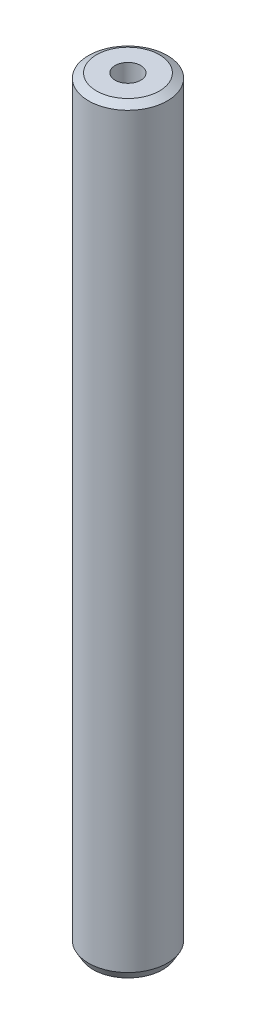
ISO-10303-21;
HEADER;
FILE_DESCRIPTION(('STEP AP214'),'2;1');
FILE_NAME('part.step','',(''),(''),'','','');
FILE_SCHEMA(('AUTOMOTIVE_DESIGN { 1 0 10303 214 1 1 1 1 }'));
ENDSEC;
DATA;
#1=APPLICATION_CONTEXT('core data for automotive mechanical design processes');
#2=APPLICATION_PROTOCOL_DEFINITION('international standard','automotive_design',2000,#1);
#3=PRODUCT_CONTEXT('',#1,'mechanical');
#4=PRODUCT('Part','Part','',(#3));
#5=PRODUCT_RELATED_PRODUCT_CATEGORY('part','',(#4));
#6=PRODUCT_DEFINITION_FORMATION('','',#4);
#7=PRODUCT_DEFINITION_CONTEXT('part definition',#1,'design');
#8=PRODUCT_DEFINITION('design','',#6,#7);
#9=PRODUCT_DEFINITION_SHAPE('','',#8);
#10=(LENGTH_UNIT() NAMED_UNIT(*) SI_UNIT(.MILLI.,.METRE.));
#11=(NAMED_UNIT(*) PLANE_ANGLE_UNIT() SI_UNIT($,.RADIAN.));
#12=(NAMED_UNIT(*) SI_UNIT($,.STERADIAN.) SOLID_ANGLE_UNIT());
#13=UNCERTAINTY_MEASURE_WITH_UNIT(LENGTH_MEASURE(1.E-05),#10,'distance_accuracy_value','');
#14=(GEOMETRIC_REPRESENTATION_CONTEXT(3) GLOBAL_UNCERTAINTY_ASSIGNED_CONTEXT((#13)) GLOBAL_UNIT_ASSIGNED_CONTEXT((#10,
#11,#12)) REPRESENTATION_CONTEXT('',''));
#15=CARTESIAN_POINT('',(0.,0.,0.));
#16=DIRECTION('',(0.,0.,1.));
#17=DIRECTION('',(1.,0.,0.));
#18=AXIS2_PLACEMENT_3D('',#15,#16,#17);
#19=CARTESIAN_POINT('',(0.,192.751851064715,0.));
#20=DIRECTION('',(0.,-1.,0.));
#21=DIRECTION('',(0.,0.,-1.));
#22=AXIS2_PLACEMENT_3D('',#19,#20,#21);
#23=CYLINDRICAL_SURFACE('',#22,10.);
#24=CARTESIAN_POINT('',(0.,191.585423618501,0.));
#25=DIRECTION('',(0.,1.,0.));
#26=DIRECTION('',(0.,0.,1.));
#27=AXIS2_PLACEMENT_3D('',#24,#25,#26);
#28=CIRCLE('',#27,10.);
#29=CARTESIAN_POINT('',(0.,191.585423618501,10.));
#30=VERTEX_POINT('',#29);
#31=EDGE_CURVE('E50',#30,#30,#28,.F.);
#32=ORIENTED_EDGE('',*,*,#31,.T.);
#33=EDGE_LOOP('',(#32));
#34=FACE_BOUND('',#33,.T.);
#35=CARTESIAN_POINT('',(0.,2.02031160018543,0.));
#36=DIRECTION('',(0.,1.,0.));
#37=DIRECTION('',(0.,0.,1.));
#38=AXIS2_PLACEMENT_3D('',#35,#36,#37);
#39=CIRCLE('',#38,10.);
#40=CARTESIAN_POINT('',(0.,2.02031160018543,10.));
#41=VERTEX_POINT('',#40);
#42=EDGE_CURVE('E51',#41,#41,#39,.T.);
#43=ORIENTED_EDGE('',*,*,#42,.T.);
#44=EDGE_LOOP('',(#43));
#45=FACE_BOUND('',#44,.T.);
#46=ADVANCED_FACE('F39',(#34,#45),#23,.T.);
#47=CARTESIAN_POINT('',(0.,192.751851064715,0.));
#48=DIRECTION('',(0.,1.,0.));
#49=DIRECTION('',(0.,0.,1.));
#50=AXIS2_PLACEMENT_3D('',#47,#48,#49);
#51=PLANE('',#50);
#52=CARTESIAN_POINT('',(0.,192.751851064715,0.));
#53=DIRECTION('',(0.,1.,0.));
#54=DIRECTION('',(0.,0.,1.));
#55=AXIS2_PLACEMENT_3D('',#52,#53,#54);
#56=CIRCLE('',#55,7.97968839981461);
#57=CARTESIAN_POINT('',(0.,192.751851064715,7.97968839981461));
#58=VERTEX_POINT('',#57);
#59=EDGE_CURVE('E54',#58,#58,#56,.T.);
#60=ORIENTED_EDGE('',*,*,#59,.T.);
#61=EDGE_LOOP('',(#60));
#62=FACE_BOUND('',#61,.T.);
#63=CARTESIAN_POINT('',(0.,192.751851064715,0.));
#64=DIRECTION('',(0.,1.,0.));
#65=DIRECTION('',(0.,0.,1.));
#66=AXIS2_PLACEMENT_3D('',#63,#64,#65);
#67=CIRCLE('',#66,3.24997536875379);
#68=CARTESIAN_POINT('',(0.,192.751851064715,3.24997536875379));
#69=VERTEX_POINT('',#68);
#70=EDGE_CURVE('E58',#69,#69,#67,.T.);
#71=ORIENTED_EDGE('',*,*,#70,.F.);
#72=EDGE_LOOP('',(#71));
#73=FACE_BOUND('',#72,.T.);
#74=ADVANCED_FACE('F69',(#62,#73),#51,.T.);
#75=CARTESIAN_POINT('',(0.,0.,0.));
#76=DIRECTION('',(0.,1.,0.));
#77=DIRECTION('',(0.,0.,1.));
#78=AXIS2_PLACEMENT_3D('',#75,#76,#77);
#79=PLANE('',#78);
#80=CARTESIAN_POINT('',(0.,0.,0.));
#81=DIRECTION('',(0.,1.,0.));
#82=DIRECTION('',(0.,0.,1.));
#83=AXIS2_PLACEMENT_3D('',#80,#81,#82);
#84=CIRCLE('',#83,8.833572553786);
#85=CARTESIAN_POINT('',(0.,0.,8.833572553786));
#86=VERTEX_POINT('',#85);
#87=EDGE_CURVE('E10',#86,#86,#84,.F.);
#88=ORIENTED_EDGE('',*,*,#87,.T.);
#89=EDGE_LOOP('',(#88));
#90=FACE_BOUND('',#89,.T.);
#91=CARTESIAN_POINT('',(0.,0.,0.));
#92=DIRECTION('',(0.,1.,0.));
#93=DIRECTION('',(0.,0.,1.));
#94=AXIS2_PLACEMENT_3D('',#91,#92,#93);
#95=CIRCLE('',#94,3.24997536875379);
#96=CARTESIAN_POINT('',(0.,0.,3.24997536875379));
#97=VERTEX_POINT('',#96);
#98=EDGE_CURVE('E63',#97,#97,#95,.T.);
#99=ORIENTED_EDGE('',*,*,#98,.T.);
#100=EDGE_LOOP('',(#99));
#101=FACE_BOUND('',#100,.T.);
#102=ADVANCED_FACE('F75',(#90,#101),#79,.F.);
#103=CARTESIAN_POINT('',(0.,192.751851064715,0.));
#104=DIRECTION('',(0.,-1.,0.));
#105=DIRECTION('',(0.,0.,-1.));
#106=AXIS2_PLACEMENT_3D('',#103,#104,#105);
#107=CYLINDRICAL_SURFACE('',#106,3.24997536875379);
#108=ORIENTED_EDGE('',*,*,#70,.T.);
#109=EDGE_LOOP('',(#108));
#110=FACE_BOUND('',#109,.T.);
#111=ORIENTED_EDGE('',*,*,#98,.F.);
#112=EDGE_LOOP('',(#111));
#113=FACE_BOUND('',#112,.T.);
#114=ADVANCED_FACE('F70',(#110,#113),#107,.F.);
#115=CARTESIAN_POINT('',(0.,192.751851064715,0.));
#116=DIRECTION('',(0.,-1.,0.));
#117=DIRECTION('',(0.,0.,-1.));
#118=AXIS2_PLACEMENT_3D('',#115,#116,#117);
#119=CONICAL_SURFACE('',#118,7.97968839981461,1.04719755119659);
#120=ORIENTED_EDGE('',*,*,#31,.F.);
#121=EDGE_LOOP('',(#120));
#122=FACE_BOUND('',#121,.T.);
#123=ORIENTED_EDGE('',*,*,#59,.F.);
#124=EDGE_LOOP('',(#123));
#125=FACE_BOUND('',#124,.T.);
#126=ADVANCED_FACE('F81',(#122,#125),#119,.T.);
#127=CARTESIAN_POINT('',(0.,2.02031160018543,0.));
#128=DIRECTION('',(0.,1.,0.));
#129=DIRECTION('',(0.,0.,1.));
#130=AXIS2_PLACEMENT_3D('',#127,#128,#129);
#131=CONICAL_SURFACE('',#130,10.,0.523598775598306);
#132=ORIENTED_EDGE('',*,*,#87,.F.);
#133=EDGE_LOOP('',(#132));
#134=FACE_BOUND('',#133,.T.);
#135=ORIENTED_EDGE('',*,*,#42,.F.);
#136=EDGE_LOOP('',(#135));
#137=FACE_BOUND('',#136,.T.);
#138=ADVANCED_FACE('F45',(#134,#137),#131,.T.);
#139=CLOSED_SHELL('',(#46,#74,#102,#114,#126,#138));
#140=MANIFOLD_SOLID_BREP('B2',#139);
#141=ADVANCED_BREP_SHAPE_REPRESENTATION('',(#18,#140),#14);
#142=SHAPE_DEFINITION_REPRESENTATION(#9,#141);
ENDSEC;
END-ISO-10303-21;
